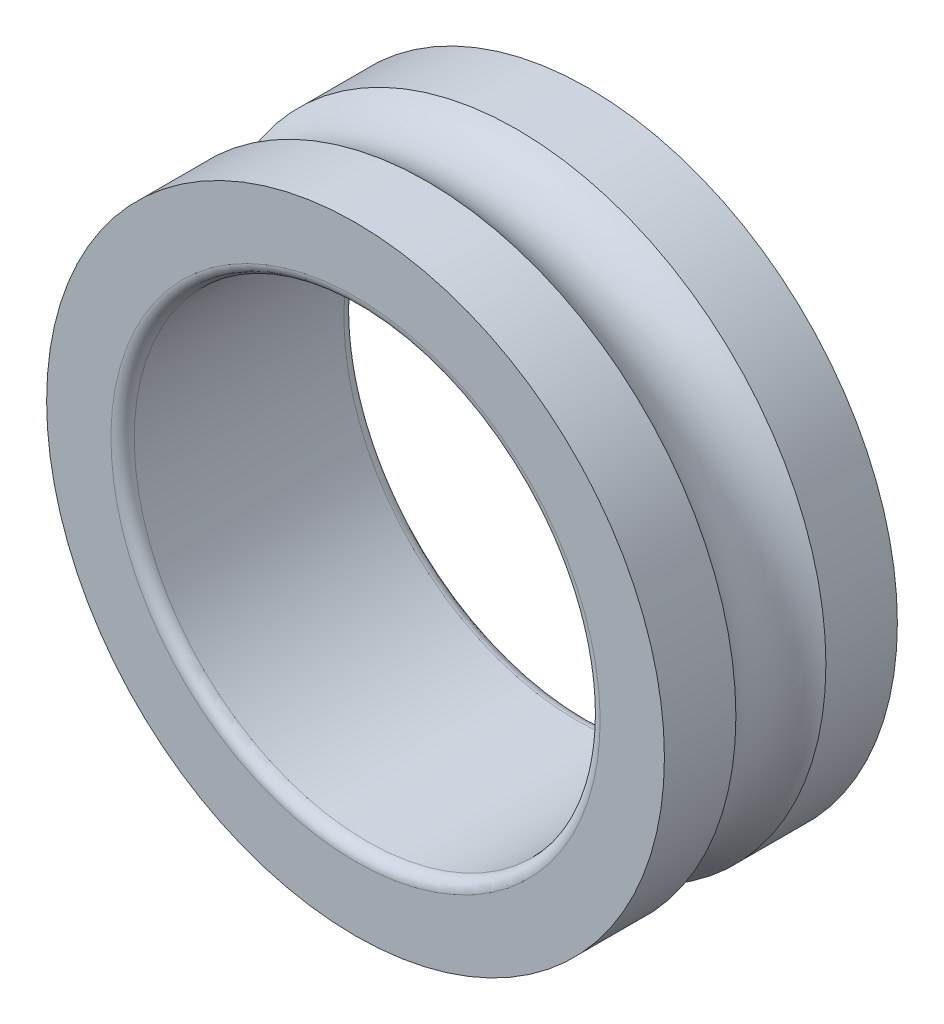
ISO-10303-21;
HEADER;
FILE_DESCRIPTION(('STEP AP214'),'2;1');
FILE_NAME('part.step','',(''),(''),'','','');
FILE_SCHEMA(('AUTOMOTIVE_DESIGN { 1 0 10303 214 1 1 1 1 }'));
ENDSEC;
DATA;
#1=APPLICATION_CONTEXT('core data for automotive mechanical design processes');
#2=APPLICATION_PROTOCOL_DEFINITION('international standard','automotive_design',2000,#1);
#3=PRODUCT_CONTEXT('',#1,'mechanical');
#4=PRODUCT('Part','Part','',(#3));
#5=PRODUCT_RELATED_PRODUCT_CATEGORY('part','',(#4));
#6=PRODUCT_DEFINITION_FORMATION('','',#4);
#7=PRODUCT_DEFINITION_CONTEXT('part definition',#1,'design');
#8=PRODUCT_DEFINITION('design','',#6,#7);
#9=PRODUCT_DEFINITION_SHAPE('','',#8);
#10=(LENGTH_UNIT() NAMED_UNIT(*) SI_UNIT(.MILLI.,.METRE.));
#11=(NAMED_UNIT(*) PLANE_ANGLE_UNIT() SI_UNIT($,.RADIAN.));
#12=(NAMED_UNIT(*) SI_UNIT($,.STERADIAN.) SOLID_ANGLE_UNIT());
#13=UNCERTAINTY_MEASURE_WITH_UNIT(LENGTH_MEASURE(1.E-05),#10,'distance_accuracy_value','');
#14=(GEOMETRIC_REPRESENTATION_CONTEXT(3) GLOBAL_UNCERTAINTY_ASSIGNED_CONTEXT((#13)) GLOBAL_UNIT_ASSIGNED_CONTEXT((#10,
#11,#12)) REPRESENTATION_CONTEXT('',''));
#15=CARTESIAN_POINT('',(0.,0.,0.));
#16=DIRECTION('',(0.,0.,1.));
#17=DIRECTION('',(1.,0.,0.));
#18=AXIS2_PLACEMENT_3D('',#15,#16,#17);
#19=CARTESIAN_POINT('',(0.,-6.66133814775094E-13,0.200000000000006));
#20=DIRECTION('',(0.,0.,-1.));
#21=DIRECTION('',(-1.,0.,0.));
#22=AXIS2_PLACEMENT_3D('',#19,#20,#21);
#23=TOROIDAL_SURFACE('',#22,4.2,0.2);
#24=CARTESIAN_POINT('',(0.,-6.66133814775094E-13,0.));
#25=DIRECTION('',(0.,0.,-1.));
#26=DIRECTION('',(0.,-1.,0.));
#27=AXIS2_PLACEMENT_3D('',#24,#25,#26);
#28=CIRCLE('',#27,4.2);
#29=CARTESIAN_POINT('',(0.,-4.20000000000067,0.));
#30=VERTEX_POINT('',#29);
#31=EDGE_CURVE('E25',#30,#30,#28,.T.);
#32=ORIENTED_EDGE('',*,*,#31,.T.);
#33=EDGE_LOOP('',(#32));
#34=FACE_BOUND('',#33,.T.);
#35=CARTESIAN_POINT('',(0.,-6.66133814775094E-13,0.200000000000006));
#36=DIRECTION('',(0.,0.,1.));
#37=DIRECTION('',(0.,-1.,0.));
#38=AXIS2_PLACEMENT_3D('',#35,#36,#37);
#39=CIRCLE('',#38,4.);
#40=CARTESIAN_POINT('',(0.,-4.00000000000067,0.200000000000006));
#41=VERTEX_POINT('',#40);
#42=EDGE_CURVE('E11',#41,#41,#39,.T.);
#43=ORIENTED_EDGE('',*,*,#42,.T.);
#44=EDGE_LOOP('',(#43));
#45=FACE_BOUND('',#44,.T.);
#46=ADVANCED_FACE('F17',(#34,#45),#23,.T.);
#47=CARTESIAN_POINT('',(0.,-6.66133814775094E-13,2.));
#48=DIRECTION('',(0.,0.,-1.));
#49=DIRECTION('',(0.,1.,0.));
#50=AXIS2_PLACEMENT_3D('',#47,#48,#49);
#51=CYLINDRICAL_SURFACE('',#50,4.);
#52=CARTESIAN_POINT('',(0.,-6.66133814775094E-13,3.8));
#53=DIRECTION('',(0.,0.,-1.));
#54=DIRECTION('',(0.,-1.,0.));
#55=AXIS2_PLACEMENT_3D('',#52,#53,#54);
#56=CIRCLE('',#55,4.);
#57=CARTESIAN_POINT('',(0.,-4.00000000000067,3.8));
#58=VERTEX_POINT('',#57);
#59=EDGE_CURVE('E78',#58,#58,#56,.T.);
#60=ORIENTED_EDGE('',*,*,#59,.F.);
#61=EDGE_LOOP('',(#60));
#62=FACE_BOUND('',#61,.T.);
#63=ORIENTED_EDGE('',*,*,#42,.F.);
#64=EDGE_LOOP('',(#63));
#65=FACE_BOUND('',#64,.T.);
#66=ADVANCED_FACE('F106',(#62,#65),#51,.F.);
#67=CARTESIAN_POINT('',(0.,4.65199999999932,0.));
#68=DIRECTION('',(0.,0.,-1.));
#69=DIRECTION('',(-1.,0.,0.));
#70=AXIS2_PLACEMENT_3D('',#67,#68,#69);
#71=PLANE('',#70);
#72=ORIENTED_EDGE('',*,*,#31,.F.);
#73=EDGE_LOOP('',(#72));
#74=FACE_BOUND('',#73,.T.);
#75=CARTESIAN_POINT('',(0.,-6.66133814775094E-13,0.));
#76=DIRECTION('',(0.,0.,-1.));
#77=DIRECTION('',(-1.,0.,0.));
#78=AXIS2_PLACEMENT_3D('',#75,#76,#77);
#79=CIRCLE('',#78,5.304);
#80=CARTESIAN_POINT('',(-5.304,-5.97311079600856E-13,0.));
#81=VERTEX_POINT('',#80);
#82=EDGE_CURVE('E72',#81,#81,#79,.T.);
#83=ORIENTED_EDGE('',*,*,#82,.T.);
#84=EDGE_LOOP('',(#83));
#85=FACE_BOUND('',#84,.T.);
#86=ADVANCED_FACE('F110',(#74,#85),#71,.T.);
#87=CARTESIAN_POINT('',(0.,-6.66133814775094E-13,3.8));
#88=DIRECTION('',(0.,0.,-1.));
#89=DIRECTION('',(-1.,0.,0.));
#90=AXIS2_PLACEMENT_3D('',#87,#88,#89);
#91=TOROIDAL_SURFACE('',#90,4.2,0.2);
#92=ORIENTED_EDGE('',*,*,#59,.T.);
#93=EDGE_LOOP('',(#92));
#94=FACE_BOUND('',#93,.T.);
#95=CARTESIAN_POINT('',(0.,-6.66133814775094E-13,4.));
#96=DIRECTION('',(0.,0.,1.));
#97=DIRECTION('',(0.,-1.,0.));
#98=AXIS2_PLACEMENT_3D('',#95,#96,#97);
#99=CIRCLE('',#98,4.2);
#100=CARTESIAN_POINT('',(0.,-4.20000000000067,4.));
#101=VERTEX_POINT('',#100);
#102=EDGE_CURVE('E71',#101,#101,#99,.T.);
#103=ORIENTED_EDGE('',*,*,#102,.T.);
#104=EDGE_LOOP('',(#103));
#105=FACE_BOUND('',#104,.T.);
#106=ADVANCED_FACE('F116',(#94,#105),#91,.T.);
#107=CARTESIAN_POINT('',(0.,4.65199999999932,4.));
#108=DIRECTION('',(0.,0.,1.));
#109=DIRECTION('',(1.,0.,0.));
#110=AXIS2_PLACEMENT_3D('',#107,#108,#109);
#111=PLANE('',#110);
#112=ORIENTED_EDGE('',*,*,#102,.F.);
#113=EDGE_LOOP('',(#112));
#114=FACE_BOUND('',#113,.T.);
#115=CARTESIAN_POINT('',(0.,-6.66133814775094E-13,4.));
#116=DIRECTION('',(0.,0.,-1.));
#117=DIRECTION('',(0.,1.,0.));
#118=AXIS2_PLACEMENT_3D('',#115,#116,#117);
#119=CIRCLE('',#118,5.304);
#120=CARTESIAN_POINT('',(0.,5.30399999999933,4.));
#121=VERTEX_POINT('',#120);
#122=EDGE_CURVE('E79',#121,#121,#119,.T.);
#123=ORIENTED_EDGE('',*,*,#122,.F.);
#124=EDGE_LOOP('',(#123));
#125=FACE_BOUND('',#124,.T.);
#126=ADVANCED_FACE('F120',(#114,#125),#111,.T.);
#127=CARTESIAN_POINT('',(0.,-6.66133814775094E-13,2.));
#128=DIRECTION('',(0.,0.,-1.));
#129=DIRECTION('',(0.984807753012206,-0.173648177666943,0.));
#130=AXIS2_PLACEMENT_3D('',#127,#128,#129);
#131=TOROIDAL_SURFACE('',#130,6.,1.04);
#132=CARTESIAN_POINT('',(0.,-6.66133814775094E-13,1.22722318875371));
#133=DIRECTION('',(0.,0.,-1.));
#134=DIRECTION('',(1.,0.,0.));
#135=AXIS2_PLACEMENT_3D('',#132,#133,#134);
#136=CIRCLE('',#135,5.304);
#137=CARTESIAN_POINT('',(5.304,-7.34956549949332E-13,1.22722318875371));
#138=VERTEX_POINT('',#137);
#139=EDGE_CURVE('E66',#138,#138,#136,.T.);
#140=ORIENTED_EDGE('',*,*,#139,.F.);
#141=EDGE_LOOP('',(#140));
#142=FACE_BOUND('',#141,.T.);
#143=CARTESIAN_POINT('',(0.,-6.66133814775094E-13,2.7727768112463));
#144=DIRECTION('',(0.,0.,-1.));
#145=DIRECTION('',(-1.,0.,0.));
#146=AXIS2_PLACEMENT_3D('',#143,#144,#145);
#147=CIRCLE('',#146,5.304);
#148=CARTESIAN_POINT('',(-5.304,-5.97311079600856E-13,2.7727768112463));
#149=VERTEX_POINT('',#148);
#150=EDGE_CURVE('E85',#149,#149,#147,.T.);
#151=ORIENTED_EDGE('',*,*,#150,.T.);
#152=EDGE_LOOP('',(#151));
#153=FACE_BOUND('',#152,.T.);
#154=ADVANCED_FACE('F92',(#142,#153),#131,.F.);
#155=CARTESIAN_POINT('',(0.,-6.66133814775094E-13,3.38638840562316));
#156=DIRECTION('',(0.,0.,-1.));
#157=DIRECTION('',(0.,1.,0.));
#158=AXIS2_PLACEMENT_3D('',#155,#156,#157);
#159=CYLINDRICAL_SURFACE('',#158,5.304);
#160=ORIENTED_EDGE('',*,*,#139,.T.);
#161=EDGE_LOOP('',(#160));
#162=FACE_BOUND('',#161,.T.);
#163=ORIENTED_EDGE('',*,*,#82,.F.);
#164=EDGE_LOOP('',(#163));
#165=FACE_BOUND('',#164,.T.);
#166=ADVANCED_FACE('F67',(#162,#165),#159,.T.);
#167=CARTESIAN_POINT('',(0.,-6.66133814775094E-13,3.38638840562316));
#168=DIRECTION('',(0.,0.,-1.));
#169=DIRECTION('',(0.,1.,0.));
#170=AXIS2_PLACEMENT_3D('',#167,#168,#169);
#171=CYLINDRICAL_SURFACE('',#170,5.304);
#172=ORIENTED_EDGE('',*,*,#122,.T.);
#173=EDGE_LOOP('',(#172));
#174=FACE_BOUND('',#173,.T.);
#175=ORIENTED_EDGE('',*,*,#150,.F.);
#176=EDGE_LOOP('',(#175));
#177=FACE_BOUND('',#176,.T.);
#178=ADVANCED_FACE('F94',(#174,#177),#171,.T.);
#179=CLOSED_SHELL('',(#46,#66,#86,#106,#126,#154,#166,#178));
#180=MANIFOLD_SOLID_BREP('B1',#179);
#181=ADVANCED_BREP_SHAPE_REPRESENTATION('',(#18,#180),#14);
#182=SHAPE_DEFINITION_REPRESENTATION(#9,#181);
ENDSEC;
END-ISO-10303-21;
